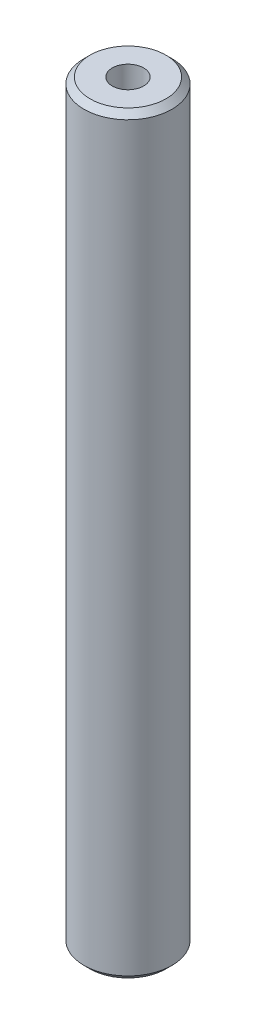
ISO-10303-21;
HEADER;
FILE_DESCRIPTION(('STEP AP214'),'2;1');
FILE_NAME('part.step','',(''),(''),'','','');
FILE_SCHEMA(('AUTOMOTIVE_DESIGN { 1 0 10303 214 1 1 1 1 }'));
ENDSEC;
DATA;
#1=APPLICATION_CONTEXT('core data for automotive mechanical design processes');
#2=APPLICATION_PROTOCOL_DEFINITION('international standard','automotive_design',2000,#1);
#3=PRODUCT_CONTEXT('',#1,'mechanical');
#4=PRODUCT('Part','Part','',(#3));
#5=PRODUCT_RELATED_PRODUCT_CATEGORY('part','',(#4));
#6=PRODUCT_DEFINITION_FORMATION('','',#4);
#7=PRODUCT_DEFINITION_CONTEXT('part definition',#1,'design');
#8=PRODUCT_DEFINITION('design','',#6,#7);
#9=PRODUCT_DEFINITION_SHAPE('','',#8);
#10=(LENGTH_UNIT() NAMED_UNIT(*) SI_UNIT(.MILLI.,.METRE.));
#11=(NAMED_UNIT(*) PLANE_ANGLE_UNIT() SI_UNIT($,.RADIAN.));
#12=(NAMED_UNIT(*) SI_UNIT($,.STERADIAN.) SOLID_ANGLE_UNIT());
#13=UNCERTAINTY_MEASURE_WITH_UNIT(LENGTH_MEASURE(1.E-05),#10,'distance_accuracy_value','');
#14=(GEOMETRIC_REPRESENTATION_CONTEXT(3) GLOBAL_UNCERTAINTY_ASSIGNED_CONTEXT((#13)) GLOBAL_UNIT_ASSIGNED_CONTEXT((#10,
#11,#12)) REPRESENTATION_CONTEXT('',''));
#15=CARTESIAN_POINT('',(0.,0.,0.));
#16=DIRECTION('',(0.,0.,1.));
#17=DIRECTION('',(1.,0.,0.));
#18=AXIS2_PLACEMENT_3D('',#15,#16,#17);
#19=CARTESIAN_POINT('',(0.,600.,0.));
#20=DIRECTION('',(0.,-1.,0.));
#21=DIRECTION('',(0.,0.,-1.));
#22=AXIS2_PLACEMENT_3D('',#19,#20,#21);
#23=CYLINDRICAL_SURFACE('',#22,35.);
#24=CARTESIAN_POINT('',(0.,595.202264850417,0.));
#25=DIRECTION('',(0.,1.,0.));
#26=DIRECTION('',(0.,0.,1.));
#27=AXIS2_PLACEMENT_3D('',#24,#25,#26);
#28=CIRCLE('',#27,35.);
#29=CARTESIAN_POINT('',(0.,595.202264850417,35.));
#30=VERTEX_POINT('',#29);
#31=EDGE_CURVE('E50',#30,#30,#28,.F.);
#32=ORIENTED_EDGE('',*,*,#31,.T.);
#33=EDGE_LOOP('',(#32));
#34=FACE_BOUND('',#33,.T.);
#35=CARTESIAN_POINT('',(0.,4.79773514958226,0.));
#36=DIRECTION('',(0.,1.,0.));
#37=DIRECTION('',(0.,0.,1.));
#38=AXIS2_PLACEMENT_3D('',#35,#36,#37);
#39=CIRCLE('',#38,35.);
#40=CARTESIAN_POINT('',(0.,4.79773514958226,35.));
#41=VERTEX_POINT('',#40);
#42=EDGE_CURVE('E51',#41,#41,#39,.T.);
#43=ORIENTED_EDGE('',*,*,#42,.T.);
#44=EDGE_LOOP('',(#43));
#45=FACE_BOUND('',#44,.T.);
#46=ADVANCED_FACE('F39',(#34,#45),#23,.T.);
#47=CARTESIAN_POINT('',(0.,600.,0.));
#48=DIRECTION('',(0.,1.,0.));
#49=DIRECTION('',(0.,0.,1.));
#50=AXIS2_PLACEMENT_3D('',#47,#48,#49);
#51=PLANE('',#50);
#52=CARTESIAN_POINT('',(0.,600.,0.));
#53=DIRECTION('',(0.,1.,0.));
#54=DIRECTION('',(0.,0.,1.));
#55=AXIS2_PLACEMENT_3D('',#52,#53,#54);
#56=CIRCLE('',#55,30.2022648504177);
#57=CARTESIAN_POINT('',(0.,600.,30.2022648504177));
#58=VERTEX_POINT('',#57);
#59=EDGE_CURVE('E54',#58,#58,#56,.T.);
#60=ORIENTED_EDGE('',*,*,#59,.T.);
#61=EDGE_LOOP('',(#60));
#62=FACE_BOUND('',#61,.T.);
#63=CARTESIAN_POINT('',(0.,600.,0.));
#64=DIRECTION('',(0.,1.,0.));
#65=DIRECTION('',(0.,0.,1.));
#66=AXIS2_PLACEMENT_3D('',#63,#64,#65);
#67=CIRCLE('',#66,12.5020698694342);
#68=CARTESIAN_POINT('',(0.,600.,12.5020698694342));
#69=VERTEX_POINT('',#68);
#70=EDGE_CURVE('E58',#69,#69,#67,.T.);
#71=ORIENTED_EDGE('',*,*,#70,.F.);
#72=EDGE_LOOP('',(#71));
#73=FACE_BOUND('',#72,.T.);
#74=ADVANCED_FACE('F69',(#62,#73),#51,.T.);
#75=CARTESIAN_POINT('',(0.,0.,0.));
#76=DIRECTION('',(0.,1.,0.));
#77=DIRECTION('',(0.,0.,1.));
#78=AXIS2_PLACEMENT_3D('',#75,#76,#77);
#79=PLANE('',#78);
#80=CARTESIAN_POINT('',(0.,0.,0.));
#81=DIRECTION('',(0.,1.,0.));
#82=DIRECTION('',(0.,0.,1.));
#83=AXIS2_PLACEMENT_3D('',#80,#81,#82);
#84=CIRCLE('',#83,30.2022648504177);
#85=CARTESIAN_POINT('',(0.,0.,30.2022648504177));
#86=VERTEX_POINT('',#85);
#87=EDGE_CURVE('E10',#86,#86,#84,.F.);
#88=ORIENTED_EDGE('',*,*,#87,.T.);
#89=EDGE_LOOP('',(#88));
#90=FACE_BOUND('',#89,.T.);
#91=CARTESIAN_POINT('',(0.,0.,0.));
#92=DIRECTION('',(0.,1.,0.));
#93=DIRECTION('',(0.,0.,1.));
#94=AXIS2_PLACEMENT_3D('',#91,#92,#93);
#95=CIRCLE('',#94,12.5020698694342);
#96=CARTESIAN_POINT('',(0.,0.,12.5020698694342));
#97=VERTEX_POINT('',#96);
#98=EDGE_CURVE('E63',#97,#97,#95,.T.);
#99=ORIENTED_EDGE('',*,*,#98,.T.);
#100=EDGE_LOOP('',(#99));
#101=FACE_BOUND('',#100,.T.);
#102=ADVANCED_FACE('F75',(#90,#101),#79,.F.);
#103=CARTESIAN_POINT('',(0.,600.,0.));
#104=DIRECTION('',(0.,-1.,0.));
#105=DIRECTION('',(0.,0.,-1.));
#106=AXIS2_PLACEMENT_3D('',#103,#104,#105);
#107=CYLINDRICAL_SURFACE('',#106,12.5020698694342);
#108=ORIENTED_EDGE('',*,*,#70,.T.);
#109=EDGE_LOOP('',(#108));
#110=FACE_BOUND('',#109,.T.);
#111=ORIENTED_EDGE('',*,*,#98,.F.);
#112=EDGE_LOOP('',(#111));
#113=FACE_BOUND('',#112,.T.);
#114=ADVANCED_FACE('F70',(#110,#113),#107,.F.);
#115=CARTESIAN_POINT('',(0.,600.,0.));
#116=DIRECTION('',(0.,-1.,0.));
#117=DIRECTION('',(0.,0.,-1.));
#118=AXIS2_PLACEMENT_3D('',#115,#116,#117);
#119=CONICAL_SURFACE('',#118,30.2022648504177,0.785398163397435);
#120=ORIENTED_EDGE('',*,*,#31,.F.);
#121=EDGE_LOOP('',(#120));
#122=FACE_BOUND('',#121,.T.);
#123=ORIENTED_EDGE('',*,*,#59,.F.);
#124=EDGE_LOOP('',(#123));
#125=FACE_BOUND('',#124,.T.);
#126=ADVANCED_FACE('F81',(#122,#125),#119,.T.);
#127=CARTESIAN_POINT('',(0.,4.79773514958226,0.));
#128=DIRECTION('',(0.,1.,0.));
#129=DIRECTION('',(0.,0.,1.));
#130=AXIS2_PLACEMENT_3D('',#127,#128,#129);
#131=CONICAL_SURFACE('',#130,35.,0.785398163397458);
#132=ORIENTED_EDGE('',*,*,#87,.F.);
#133=EDGE_LOOP('',(#132));
#134=FACE_BOUND('',#133,.T.);
#135=ORIENTED_EDGE('',*,*,#42,.F.);
#136=EDGE_LOOP('',(#135));
#137=FACE_BOUND('',#136,.T.);
#138=ADVANCED_FACE('F45',(#134,#137),#131,.T.);
#139=CLOSED_SHELL('',(#46,#74,#102,#114,#126,#138));
#140=MANIFOLD_SOLID_BREP('B2',#139);
#141=ADVANCED_BREP_SHAPE_REPRESENTATION('',(#18,#140),#14);
#142=SHAPE_DEFINITION_REPRESENTATION(#9,#141);
ENDSEC;
END-ISO-10303-21;
